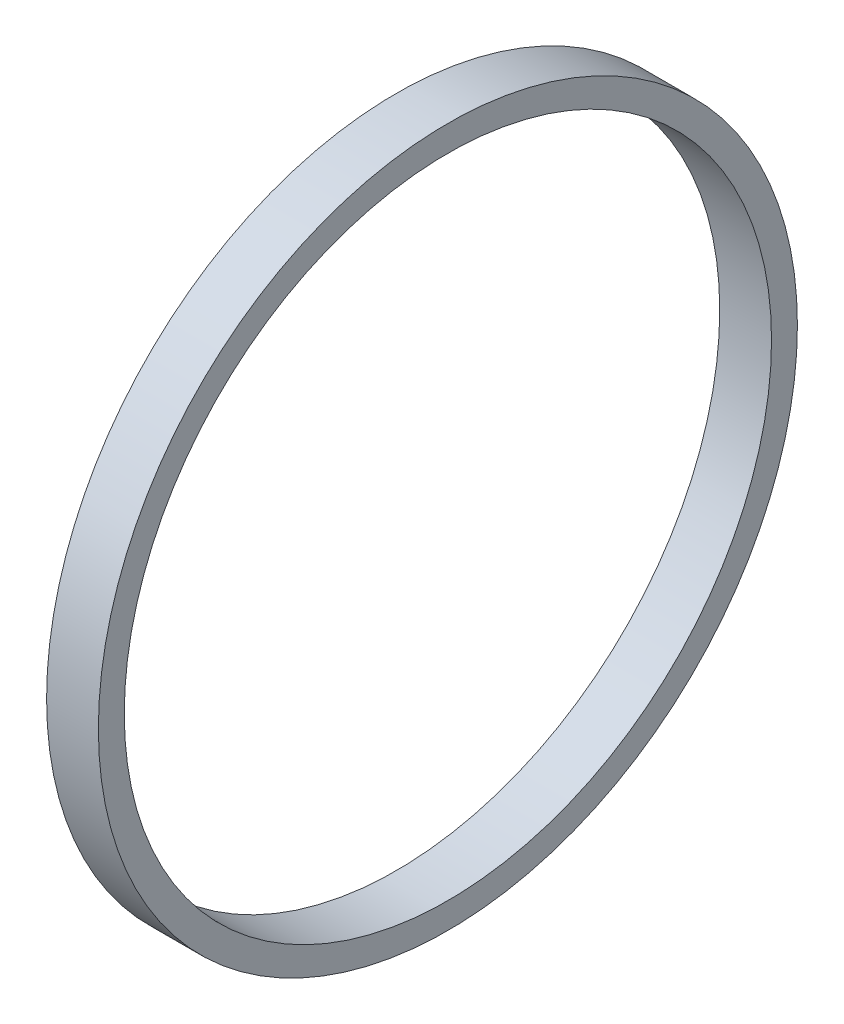
ISO-10303-21;
HEADER;
FILE_DESCRIPTION(('STEP AP214'),'2;1');
FILE_NAME('part.step','',(''),(''),'','','');
FILE_SCHEMA(('AUTOMOTIVE_DESIGN { 1 0 10303 214 1 1 1 1 }'));
ENDSEC;
DATA;
#1=APPLICATION_CONTEXT('core data for automotive mechanical design processes');
#2=APPLICATION_PROTOCOL_DEFINITION('international standard','automotive_design',2000,#1);
#3=PRODUCT_CONTEXT('',#1,'mechanical');
#4=PRODUCT('Part','Part','',(#3));
#5=PRODUCT_RELATED_PRODUCT_CATEGORY('part','',(#4));
#6=PRODUCT_DEFINITION_FORMATION('','',#4);
#7=PRODUCT_DEFINITION_CONTEXT('part definition',#1,'design');
#8=PRODUCT_DEFINITION('design','',#6,#7);
#9=PRODUCT_DEFINITION_SHAPE('','',#8);
#10=(LENGTH_UNIT() NAMED_UNIT(*) SI_UNIT(.MILLI.,.METRE.));
#11=(NAMED_UNIT(*) PLANE_ANGLE_UNIT() SI_UNIT($,.RADIAN.));
#12=(NAMED_UNIT(*) SI_UNIT($,.STERADIAN.) SOLID_ANGLE_UNIT());
#13=UNCERTAINTY_MEASURE_WITH_UNIT(LENGTH_MEASURE(1.E-05),#10,'distance_accuracy_value','');
#14=(GEOMETRIC_REPRESENTATION_CONTEXT(3) GLOBAL_UNCERTAINTY_ASSIGNED_CONTEXT((#13)) GLOBAL_UNIT_ASSIGNED_CONTEXT((#10,
#11,#12)) REPRESENTATION_CONTEXT('',''));
#15=CARTESIAN_POINT('',(0.,0.,0.));
#16=DIRECTION('',(0.,0.,1.));
#17=DIRECTION('',(1.,0.,0.));
#18=AXIS2_PLACEMENT_3D('',#15,#16,#17);
#19=CARTESIAN_POINT('',(2.,0.,0.));
#20=DIRECTION('',(1.,0.,0.));
#21=DIRECTION('',(0.,0.,-1.));
#22=AXIS2_PLACEMENT_3D('',#19,#20,#21);
#23=PLANE('',#22);
#24=CARTESIAN_POINT('',(2.,0.,0.));
#25=DIRECTION('',(1.,0.,0.));
#26=DIRECTION('',(0.,0.,-1.));
#27=AXIS2_PLACEMENT_3D('',#24,#25,#26);
#28=CIRCLE('',#27,13.5);
#29=CARTESIAN_POINT('',(2.,0.,-13.5));
#30=VERTEX_POINT('',#29);
#31=EDGE_CURVE('E10',#30,#30,#28,.T.);
#32=ORIENTED_EDGE('',*,*,#31,.T.);
#33=EDGE_LOOP('',(#32));
#34=FACE_BOUND('',#33,.T.);
#35=CARTESIAN_POINT('',(2.,0.,0.));
#36=DIRECTION('',(1.,0.,0.));
#37=DIRECTION('',(0.,0.,-1.));
#38=AXIS2_PLACEMENT_3D('',#35,#36,#37);
#39=CIRCLE('',#38,12.5);
#40=CARTESIAN_POINT('',(2.,0.,-12.5));
#41=VERTEX_POINT('',#40);
#42=EDGE_CURVE('E41',#41,#41,#39,.T.);
#43=ORIENTED_EDGE('',*,*,#42,.F.);
#44=EDGE_LOOP('',(#43));
#45=FACE_BOUND('',#44,.T.);
#46=ADVANCED_FACE('F30',(#34,#45),#23,.T.);
#47=CARTESIAN_POINT('',(0.,0.,0.));
#48=DIRECTION('',(1.,0.,0.));
#49=DIRECTION('',(0.,0.,-1.));
#50=AXIS2_PLACEMENT_3D('',#47,#48,#49);
#51=PLANE('',#50);
#52=CARTESIAN_POINT('',(0.,0.,0.));
#53=DIRECTION('',(1.,0.,0.));
#54=DIRECTION('',(0.,0.,-1.));
#55=AXIS2_PLACEMENT_3D('',#52,#53,#54);
#56=CIRCLE('',#55,13.5);
#57=CARTESIAN_POINT('',(0.,0.,-13.5));
#58=VERTEX_POINT('',#57);
#59=EDGE_CURVE('E34',#58,#58,#56,.T.);
#60=ORIENTED_EDGE('',*,*,#59,.F.);
#61=EDGE_LOOP('',(#60));
#62=FACE_BOUND('',#61,.T.);
#63=CARTESIAN_POINT('',(0.,0.,0.));
#64=DIRECTION('',(1.,0.,0.));
#65=DIRECTION('',(0.,0.,-1.));
#66=AXIS2_PLACEMENT_3D('',#63,#64,#65);
#67=CIRCLE('',#66,12.5);
#68=CARTESIAN_POINT('',(0.,0.,-12.5));
#69=VERTEX_POINT('',#68);
#70=EDGE_CURVE('E43',#69,#69,#67,.T.);
#71=ORIENTED_EDGE('',*,*,#70,.T.);
#72=EDGE_LOOP('',(#71));
#73=FACE_BOUND('',#72,.T.);
#74=ADVANCED_FACE('F53',(#62,#73),#51,.F.);
#75=CARTESIAN_POINT('',(2.,0.,0.));
#76=DIRECTION('',(-1.,0.,0.));
#77=DIRECTION('',(0.,0.,1.));
#78=AXIS2_PLACEMENT_3D('',#75,#76,#77);
#79=CYLINDRICAL_SURFACE('',#78,13.5);
#80=ORIENTED_EDGE('',*,*,#31,.F.);
#81=EDGE_LOOP('',(#80));
#82=FACE_BOUND('',#81,.T.);
#83=ORIENTED_EDGE('',*,*,#59,.T.);
#84=EDGE_LOOP('',(#83));
#85=FACE_BOUND('',#84,.T.);
#86=ADVANCED_FACE('F32',(#82,#85),#79,.T.);
#87=CARTESIAN_POINT('',(2.,0.,0.));
#88=DIRECTION('',(-1.,0.,0.));
#89=DIRECTION('',(0.,0.,1.));
#90=AXIS2_PLACEMENT_3D('',#87,#88,#89);
#91=CYLINDRICAL_SURFACE('',#90,12.5);
#92=ORIENTED_EDGE('',*,*,#42,.T.);
#93=EDGE_LOOP('',(#92));
#94=FACE_BOUND('',#93,.T.);
#95=ORIENTED_EDGE('',*,*,#70,.F.);
#96=EDGE_LOOP('',(#95));
#97=FACE_BOUND('',#96,.T.);
#98=ADVANCED_FACE('F49',(#94,#97),#91,.F.);
#99=CLOSED_SHELL('',(#46,#74,#86,#98));
#100=MANIFOLD_SOLID_BREP('B2',#99);
#101=ADVANCED_BREP_SHAPE_REPRESENTATION('',(#18,#100),#14);
#102=SHAPE_DEFINITION_REPRESENTATION(#9,#101);
ENDSEC;
END-ISO-10303-21;
